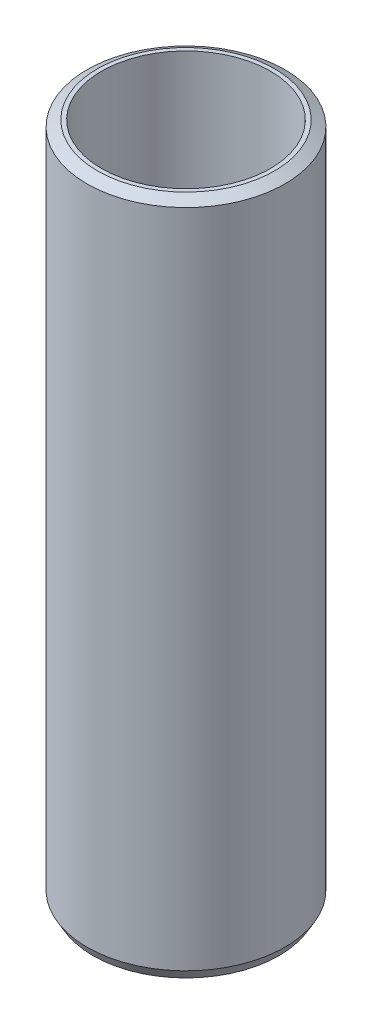
ISO-10303-21;
HEADER;
FILE_DESCRIPTION(('STEP AP214'),'2;1');
FILE_NAME('part.step','',(''),(''),'','','');
FILE_SCHEMA(('AUTOMOTIVE_DESIGN { 1 0 10303 214 1 1 1 1 }'));
ENDSEC;
DATA;
#1=APPLICATION_CONTEXT('core data for automotive mechanical design processes');
#2=APPLICATION_PROTOCOL_DEFINITION('international standard','automotive_design',2000,#1);
#3=PRODUCT_CONTEXT('',#1,'mechanical');
#4=PRODUCT('Part','Part','',(#3));
#5=PRODUCT_RELATED_PRODUCT_CATEGORY('part','',(#4));
#6=PRODUCT_DEFINITION_FORMATION('','',#4);
#7=PRODUCT_DEFINITION_CONTEXT('part definition',#1,'design');
#8=PRODUCT_DEFINITION('design','',#6,#7);
#9=PRODUCT_DEFINITION_SHAPE('','',#8);
#10=(LENGTH_UNIT() NAMED_UNIT(*) SI_UNIT(.MILLI.,.METRE.));
#11=(NAMED_UNIT(*) PLANE_ANGLE_UNIT() SI_UNIT($,.RADIAN.));
#12=(NAMED_UNIT(*) SI_UNIT($,.STERADIAN.) SOLID_ANGLE_UNIT());
#13=UNCERTAINTY_MEASURE_WITH_UNIT(LENGTH_MEASURE(1.E-05),#10,'distance_accuracy_value','');
#14=(GEOMETRIC_REPRESENTATION_CONTEXT(3) GLOBAL_UNCERTAINTY_ASSIGNED_CONTEXT((#13)) GLOBAL_UNIT_ASSIGNED_CONTEXT((#10,
#11,#12)) REPRESENTATION_CONTEXT('',''));
#15=CARTESIAN_POINT('',(0.,0.,0.));
#16=DIRECTION('',(0.,0.,1.));
#17=DIRECTION('',(1.,0.,0.));
#18=AXIS2_PLACEMENT_3D('',#15,#16,#17);
#19=CARTESIAN_POINT('',(0.,376.475175346629,0.));
#20=DIRECTION('',(0.,-1.,0.));
#21=DIRECTION('',(0.,0.,-1.));
#22=AXIS2_PLACEMENT_3D('',#19,#20,#21);
#23=CYLINDRICAL_SURFACE('',#22,55.);
#24=CARTESIAN_POINT('',(0.,373.128724771732,0.));
#25=DIRECTION('',(0.,1.,0.));
#26=DIRECTION('',(0.,0.,1.));
#27=AXIS2_PLACEMENT_3D('',#24,#25,#26);
#28=CIRCLE('',#27,55.);
#29=CARTESIAN_POINT('',(0.,373.128724771732,55.));
#30=VERTEX_POINT('',#29);
#31=EDGE_CURVE('E50',#30,#30,#28,.F.);
#32=ORIENTED_EDGE('',*,*,#31,.T.);
#33=EDGE_LOOP('',(#32));
#34=FACE_BOUND('',#33,.T.);
#35=CARTESIAN_POINT('',(0.,5.79622242074013,0.));
#36=DIRECTION('',(0.,1.,0.));
#37=DIRECTION('',(0.,0.,1.));
#38=AXIS2_PLACEMENT_3D('',#35,#36,#37);
#39=CIRCLE('',#38,55.);
#40=CARTESIAN_POINT('',(0.,5.79622242074013,55.));
#41=VERTEX_POINT('',#40);
#42=EDGE_CURVE('E51',#41,#41,#39,.T.);
#43=ORIENTED_EDGE('',*,*,#42,.T.);
#44=EDGE_LOOP('',(#43));
#45=FACE_BOUND('',#44,.T.);
#46=ADVANCED_FACE('F39',(#34,#45),#23,.T.);
#47=CARTESIAN_POINT('',(0.,376.475175346629,0.));
#48=DIRECTION('',(0.,1.,0.));
#49=DIRECTION('',(0.,0.,1.));
#50=AXIS2_PLACEMENT_3D('',#47,#48,#49);
#51=PLANE('',#50);
#52=CARTESIAN_POINT('',(0.,376.475175346629,0.));
#53=DIRECTION('',(0.,1.,0.));
#54=DIRECTION('',(0.,0.,1.));
#55=AXIS2_PLACEMENT_3D('',#52,#53,#54);
#56=CIRCLE('',#55,49.2037775792598);
#57=CARTESIAN_POINT('',(0.,376.475175346629,49.2037775792598));
#58=VERTEX_POINT('',#57);
#59=EDGE_CURVE('E54',#58,#58,#56,.T.);
#60=ORIENTED_EDGE('',*,*,#59,.T.);
#61=EDGE_LOOP('',(#60));
#62=FACE_BOUND('',#61,.T.);
#63=CARTESIAN_POINT('',(0.,376.475175346629,0.));
#64=DIRECTION('',(0.,1.,0.));
#65=DIRECTION('',(0.,0.,1.));
#66=AXIS2_PLACEMENT_3D('',#63,#64,#65);
#67=CIRCLE('',#66,46.9107078811137);
#68=CARTESIAN_POINT('',(0.,376.475175346629,46.9107078811137));
#69=VERTEX_POINT('',#68);
#70=EDGE_CURVE('E58',#69,#69,#67,.T.);
#71=ORIENTED_EDGE('',*,*,#70,.F.);
#72=EDGE_LOOP('',(#71));
#73=FACE_BOUND('',#72,.T.);
#74=ADVANCED_FACE('F69',(#62,#73),#51,.T.);
#75=CARTESIAN_POINT('',(0.,0.,0.));
#76=DIRECTION('',(0.,1.,0.));
#77=DIRECTION('',(0.,0.,1.));
#78=AXIS2_PLACEMENT_3D('',#75,#76,#77);
#79=PLANE('',#78);
#80=CARTESIAN_POINT('',(0.,0.,0.));
#81=DIRECTION('',(0.,1.,0.));
#82=DIRECTION('',(0.,0.,1.));
#83=AXIS2_PLACEMENT_3D('',#80,#81,#82);
#84=CIRCLE('',#83,51.6535494251028);
#85=CARTESIAN_POINT('',(0.,0.,51.6535494251028));
#86=VERTEX_POINT('',#85);
#87=EDGE_CURVE('E10',#86,#86,#84,.F.);
#88=ORIENTED_EDGE('',*,*,#87,.T.);
#89=EDGE_LOOP('',(#88));
#90=FACE_BOUND('',#89,.T.);
#91=CARTESIAN_POINT('',(0.,0.,0.));
#92=DIRECTION('',(0.,1.,0.));
#93=DIRECTION('',(0.,0.,1.));
#94=AXIS2_PLACEMENT_3D('',#91,#92,#93);
#95=CIRCLE('',#94,46.9107078811137);
#96=CARTESIAN_POINT('',(0.,0.,46.9107078811137));
#97=VERTEX_POINT('',#96);
#98=EDGE_CURVE('E63',#97,#97,#95,.T.);
#99=ORIENTED_EDGE('',*,*,#98,.T.);
#100=EDGE_LOOP('',(#99));
#101=FACE_BOUND('',#100,.T.);
#102=ADVANCED_FACE('F75',(#90,#101),#79,.F.);
#103=CARTESIAN_POINT('',(0.,376.475175346629,0.));
#104=DIRECTION('',(0.,-1.,0.));
#105=DIRECTION('',(0.,0.,-1.));
#106=AXIS2_PLACEMENT_3D('',#103,#104,#105);
#107=CYLINDRICAL_SURFACE('',#106,46.9107078811137);
#108=ORIENTED_EDGE('',*,*,#70,.T.);
#109=EDGE_LOOP('',(#108));
#110=FACE_BOUND('',#109,.T.);
#111=ORIENTED_EDGE('',*,*,#98,.F.);
#112=EDGE_LOOP('',(#111));
#113=FACE_BOUND('',#112,.T.);
#114=ADVANCED_FACE('F70',(#110,#113),#107,.F.);
#115=CARTESIAN_POINT('',(0.,376.475175346629,0.));
#116=DIRECTION('',(0.,-1.,0.));
#117=DIRECTION('',(0.,0.,-1.));
#118=AXIS2_PLACEMENT_3D('',#115,#116,#117);
#119=CONICAL_SURFACE('',#118,49.2037775792598,1.04719755119659);
#120=ORIENTED_EDGE('',*,*,#31,.F.);
#121=EDGE_LOOP('',(#120));
#122=FACE_BOUND('',#121,.T.);
#123=ORIENTED_EDGE('',*,*,#59,.F.);
#124=EDGE_LOOP('',(#123));
#125=FACE_BOUND('',#124,.T.);
#126=ADVANCED_FACE('F81',(#122,#125),#119,.T.);
#127=CARTESIAN_POINT('',(0.,5.79622242074013,0.));
#128=DIRECTION('',(0.,1.,0.));
#129=DIRECTION('',(0.,0.,1.));
#130=AXIS2_PLACEMENT_3D('',#127,#128,#129);
#131=CONICAL_SURFACE('',#130,55.,0.523598775598298);
#132=ORIENTED_EDGE('',*,*,#87,.F.);
#133=EDGE_LOOP('',(#132));
#134=FACE_BOUND('',#133,.T.);
#135=ORIENTED_EDGE('',*,*,#42,.F.);
#136=EDGE_LOOP('',(#135));
#137=FACE_BOUND('',#136,.T.);
#138=ADVANCED_FACE('F45',(#134,#137),#131,.T.);
#139=CLOSED_SHELL('',(#46,#74,#102,#114,#126,#138));
#140=MANIFOLD_SOLID_BREP('B2',#139);
#141=ADVANCED_BREP_SHAPE_REPRESENTATION('',(#18,#140),#14);
#142=SHAPE_DEFINITION_REPRESENTATION(#9,#141);
ENDSEC;
END-ISO-10303-21;
